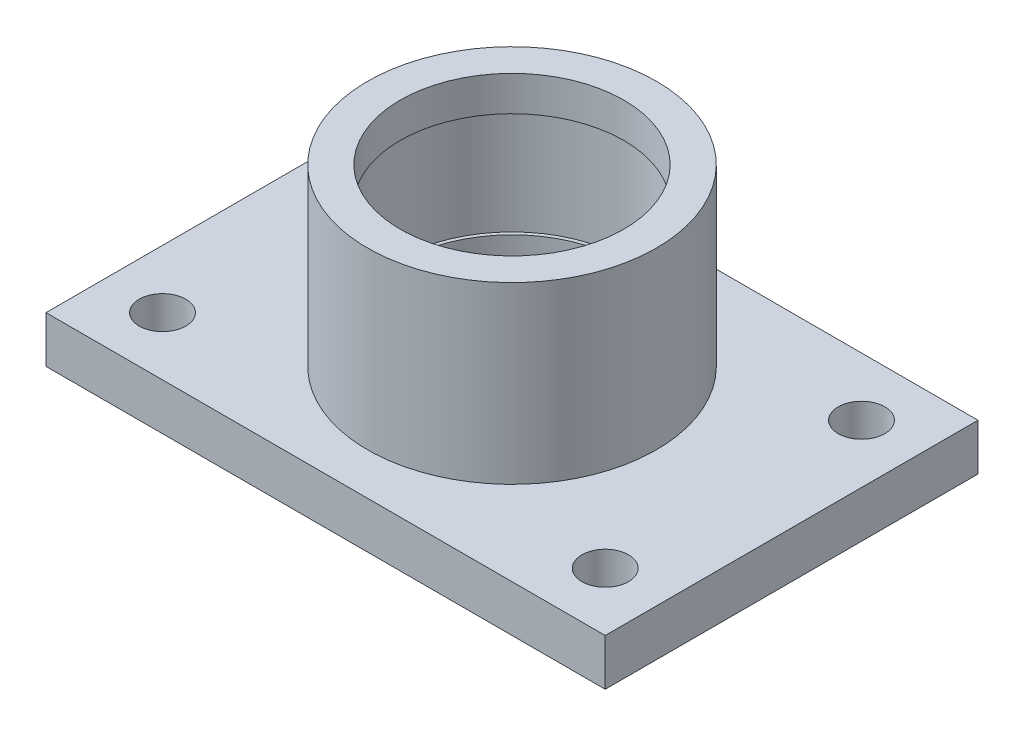
ISO-10303-21;
HEADER;
FILE_DESCRIPTION(('STEP AP214'),'2;1');
FILE_NAME('part.step','',(''),(''),'','','');
FILE_SCHEMA(('AUTOMOTIVE_DESIGN { 1 0 10303 214 1 1 1 1 }'));
ENDSEC;
DATA;
#1=APPLICATION_CONTEXT('core data for automotive mechanical design processes');
#2=APPLICATION_PROTOCOL_DEFINITION('international standard','automotive_design',2000,#1);
#3=PRODUCT_CONTEXT('',#1,'mechanical');
#4=PRODUCT('Part','Part','',(#3));
#5=PRODUCT_RELATED_PRODUCT_CATEGORY('part','',(#4));
#6=PRODUCT_DEFINITION_FORMATION('','',#4);
#7=PRODUCT_DEFINITION_CONTEXT('part definition',#1,'design');
#8=PRODUCT_DEFINITION('design','',#6,#7);
#9=PRODUCT_DEFINITION_SHAPE('','',#8);
#10=(LENGTH_UNIT() NAMED_UNIT(*) SI_UNIT(.MILLI.,.METRE.));
#11=(NAMED_UNIT(*) PLANE_ANGLE_UNIT() SI_UNIT($,.RADIAN.));
#12=(NAMED_UNIT(*) SI_UNIT($,.STERADIAN.) SOLID_ANGLE_UNIT());
#13=UNCERTAINTY_MEASURE_WITH_UNIT(LENGTH_MEASURE(1.E-05),#10,'distance_accuracy_value','');
#14=(GEOMETRIC_REPRESENTATION_CONTEXT(3) GLOBAL_UNCERTAINTY_ASSIGNED_CONTEXT((#13)) GLOBAL_UNIT_ASSIGNED_CONTEXT((#10,
#11,#12)) REPRESENTATION_CONTEXT('',''));
#15=CARTESIAN_POINT('',(0.,0.,0.));
#16=DIRECTION('',(0.,0.,1.));
#17=DIRECTION('',(1.,0.,0.));
#18=AXIS2_PLACEMENT_3D('',#15,#16,#17);
#19=CARTESIAN_POINT('',(95.,20.,55.));
#20=DIRECTION('',(0.,-1.,0.));
#21=DIRECTION('',(0.,0.,-1.));
#22=AXIS2_PLACEMENT_3D('',#19,#20,#21);
#23=CYLINDRICAL_SURFACE('',#22,9.99999999999999);
#24=CARTESIAN_POINT('',(95.,20.,55.));
#25=DIRECTION('',(0.,-1.,0.));
#26=DIRECTION('',(0.,0.,-1.));
#27=AXIS2_PLACEMENT_3D('',#24,#25,#26);
#28=CIRCLE('',#27,9.99999999999999);
#29=CARTESIAN_POINT('',(95.,20.,45.));
#30=VERTEX_POINT('',#29);
#31=EDGE_CURVE('E187',#30,#30,#28,.T.);
#32=ORIENTED_EDGE('',*,*,#31,.F.);
#33=EDGE_LOOP('',(#32));
#34=FACE_BOUND('',#33,.T.);
#35=CARTESIAN_POINT('',(95.,3.,55.));
#36=DIRECTION('',(0.,-1.,0.));
#37=DIRECTION('',(0.,0.,-1.));
#38=AXIS2_PLACEMENT_3D('',#35,#36,#37);
#39=CIRCLE('',#38,9.99999999999999);
#40=CARTESIAN_POINT('',(95.,3.,45.));
#41=VERTEX_POINT('',#40);
#42=EDGE_CURVE('E178',#41,#41,#39,.F.);
#43=ORIENTED_EDGE('',*,*,#42,.F.);
#44=EDGE_LOOP('',(#43));
#45=FACE_BOUND('',#44,.T.);
#46=ADVANCED_FACE('F39',(#34,#45),#23,.F.);
#47=CARTESIAN_POINT('',(-95.,20.,54.9999999999987));
#48=DIRECTION('',(0.,-1.,0.));
#49=DIRECTION('',(0.,0.,-1.));
#50=AXIS2_PLACEMENT_3D('',#47,#48,#49);
#51=CYLINDRICAL_SURFACE('',#50,9.99999999999999);
#52=CARTESIAN_POINT('',(-95.,20.,54.9999999999987));
#53=DIRECTION('',(0.,-1.,0.));
#54=DIRECTION('',(0.,0.,-1.));
#55=AXIS2_PLACEMENT_3D('',#52,#53,#54);
#56=CIRCLE('',#55,9.99999999999999);
#57=CARTESIAN_POINT('',(-95.,20.,44.9999999999987));
#58=VERTEX_POINT('',#57);
#59=EDGE_CURVE('E183',#58,#58,#56,.T.);
#60=ORIENTED_EDGE('',*,*,#59,.F.);
#61=EDGE_LOOP('',(#60));
#62=FACE_BOUND('',#61,.T.);
#63=CARTESIAN_POINT('',(-95.,3.,54.9999999999987));
#64=DIRECTION('',(0.,-1.,0.));
#65=DIRECTION('',(0.,0.,-1.));
#66=AXIS2_PLACEMENT_3D('',#63,#64,#65);
#67=CIRCLE('',#66,9.99999999999999);
#68=CARTESIAN_POINT('',(-95.,3.,44.9999999999987));
#69=VERTEX_POINT('',#68);
#70=EDGE_CURVE('E174',#69,#69,#67,.F.);
#71=ORIENTED_EDGE('',*,*,#70,.F.);
#72=EDGE_LOOP('',(#71));
#73=FACE_BOUND('',#72,.T.);
#74=ADVANCED_FACE('F286',(#62,#73),#51,.F.);
#75=CARTESIAN_POINT('',(-94.9999999999988,20.,-55.0000000000013));
#76=DIRECTION('',(0.,-1.,0.));
#77=DIRECTION('',(0.,0.,-1.));
#78=AXIS2_PLACEMENT_3D('',#75,#76,#77);
#79=CYLINDRICAL_SURFACE('',#78,9.99999999999999);
#80=CARTESIAN_POINT('',(-94.9999999999988,20.,-55.0000000000013));
#81=DIRECTION('',(0.,-1.,0.));
#82=DIRECTION('',(0.,0.,-1.));
#83=AXIS2_PLACEMENT_3D('',#80,#81,#82);
#84=CIRCLE('',#83,9.99999999999999);
#85=CARTESIAN_POINT('',(-94.9999999999988,20.,-65.0000000000013));
#86=VERTEX_POINT('',#85);
#87=EDGE_CURVE('E188',#86,#86,#84,.T.);
#88=ORIENTED_EDGE('',*,*,#87,.F.);
#89=EDGE_LOOP('',(#88));
#90=FACE_BOUND('',#89,.T.);
#91=CARTESIAN_POINT('',(-94.9999999999988,3.,-55.0000000000013));
#92=DIRECTION('',(0.,-1.,0.));
#93=DIRECTION('',(0.,0.,-1.));
#94=AXIS2_PLACEMENT_3D('',#91,#92,#93);
#95=CIRCLE('',#94,9.99999999999999);
#96=CARTESIAN_POINT('',(-94.9999999999988,3.,-65.0000000000013));
#97=VERTEX_POINT('',#96);
#98=EDGE_CURVE('E170',#97,#97,#95,.F.);
#99=ORIENTED_EDGE('',*,*,#98,.F.);
#100=EDGE_LOOP('',(#99));
#101=FACE_BOUND('',#100,.T.);
#102=ADVANCED_FACE('F292',(#90,#101),#79,.F.);
#103=CARTESIAN_POINT('',(95.0000000000012,20.,-55.));
#104=DIRECTION('',(0.,-1.,0.));
#105=DIRECTION('',(0.,0.,-1.));
#106=AXIS2_PLACEMENT_3D('',#103,#104,#105);
#107=CYLINDRICAL_SURFACE('',#106,9.99999999999999);
#108=CARTESIAN_POINT('',(95.0000000000012,20.,-55.));
#109=DIRECTION('',(0.,-1.,0.));
#110=DIRECTION('',(0.,0.,-1.));
#111=AXIS2_PLACEMENT_3D('',#108,#109,#110);
#112=CIRCLE('',#111,9.99999999999999);
#113=CARTESIAN_POINT('',(95.0000000000012,20.,-65.));
#114=VERTEX_POINT('',#113);
#115=EDGE_CURVE('E182',#114,#114,#112,.T.);
#116=ORIENTED_EDGE('',*,*,#115,.F.);
#117=EDGE_LOOP('',(#116));
#118=FACE_BOUND('',#117,.T.);
#119=CARTESIAN_POINT('',(95.0000000000012,3.,-55.));
#120=DIRECTION('',(0.,-1.,0.));
#121=DIRECTION('',(0.,0.,-1.));
#122=AXIS2_PLACEMENT_3D('',#119,#120,#121);
#123=CIRCLE('',#122,9.99999999999999);
#124=CARTESIAN_POINT('',(95.0000000000012,3.,-65.));
#125=VERTEX_POINT('',#124);
#126=EDGE_CURVE('E43',#125,#125,#123,.F.);
#127=ORIENTED_EDGE('',*,*,#126,.F.);
#128=EDGE_LOOP('',(#127));
#129=FACE_BOUND('',#128,.T.);
#130=ADVANCED_FACE('F299',(#118,#129),#107,.F.);
#131=CARTESIAN_POINT('',(-120.,20.,80.));
#132=DIRECTION('',(1.,0.,0.));
#133=DIRECTION('',(0.,0.,-1.));
#134=AXIS2_PLACEMENT_3D('',#131,#132,#133);
#135=PLANE('',#134);
#136=DIRECTION('',(0.,0.,1.));
#137=VECTOR('',#136,1.);
#138=CARTESIAN_POINT('',(-120.,0.,80.));
#139=LINE('',#138,#137);
#140=CARTESIAN_POINT('',(-120.,0.,-80.));
#141=VERTEX_POINT('',#140);
#142=CARTESIAN_POINT('',(-120.,0.,80.));
#143=VERTEX_POINT('',#142);
#144=EDGE_CURVE('E230',#141,#143,#139,.T.);
#145=ORIENTED_EDGE('',*,*,#144,.T.);
#146=DIRECTION('',(0.,-1.,0.));
#147=VECTOR('',#146,1.);
#148=CARTESIAN_POINT('',(-120.,20.,80.));
#149=LINE('',#148,#147);
#150=CARTESIAN_POINT('',(-120.,20.,80.));
#151=VERTEX_POINT('',#150);
#152=EDGE_CURVE('E11',#151,#143,#149,.T.);
#153=ORIENTED_EDGE('',*,*,#152,.F.);
#154=DIRECTION('',(0.,0.,1.));
#155=VECTOR('',#154,1.);
#156=CARTESIAN_POINT('',(-120.,20.,80.));
#157=LINE('',#156,#155);
#158=CARTESIAN_POINT('',(-120.,20.,-80.));
#159=VERTEX_POINT('',#158);
#160=EDGE_CURVE('E231',#159,#151,#157,.T.);
#161=ORIENTED_EDGE('',*,*,#160,.F.);
#162=DIRECTION('',(0.,-1.,0.));
#163=VECTOR('',#162,1.);
#164=CARTESIAN_POINT('',(-120.,20.,-80.));
#165=LINE('',#164,#163);
#166=EDGE_CURVE('E241',#159,#141,#165,.T.);
#167=ORIENTED_EDGE('',*,*,#166,.T.);
#168=EDGE_LOOP('',(#145,#153,#161,#167));
#169=FACE_BOUND('',#168,.T.);
#170=ADVANCED_FACE('F41',(#169),#135,.F.);
#171=CARTESIAN_POINT('',(-120.,20.,80.));
#172=DIRECTION('',(0.,0.,-1.));
#173=DIRECTION('',(-1.,0.,0.));
#174=AXIS2_PLACEMENT_3D('',#171,#172,#173);
#175=PLANE('',#174);
#176=DIRECTION('',(1.,0.,0.));
#177=VECTOR('',#176,1.);
#178=CARTESIAN_POINT('',(-120.,0.,80.));
#179=LINE('',#178,#177);
#180=CARTESIAN_POINT('',(120.,0.,80.));
#181=VERTEX_POINT('',#180);
#182=EDGE_CURVE('E245',#143,#181,#179,.T.);
#183=ORIENTED_EDGE('',*,*,#182,.T.);
#184=DIRECTION('',(0.,-1.,0.));
#185=VECTOR('',#184,1.);
#186=CARTESIAN_POINT('',(120.,20.,80.));
#187=LINE('',#186,#185);
#188=CARTESIAN_POINT('',(120.,20.,80.));
#189=VERTEX_POINT('',#188);
#190=EDGE_CURVE('E49',#189,#181,#187,.T.);
#191=ORIENTED_EDGE('',*,*,#190,.F.);
#192=DIRECTION('',(1.,0.,0.));
#193=VECTOR('',#192,1.);
#194=CARTESIAN_POINT('',(-120.,20.,80.));
#195=LINE('',#194,#193);
#196=EDGE_CURVE('E93',#151,#189,#195,.T.);
#197=ORIENTED_EDGE('',*,*,#196,.F.);
#198=ORIENTED_EDGE('',*,*,#152,.T.);
#199=EDGE_LOOP('',(#183,#191,#197,#198));
#200=FACE_BOUND('',#199,.T.);
#201=ADVANCED_FACE('F282',(#200),#175,.F.);
#202=CARTESIAN_POINT('',(120.,20.,80.));
#203=DIRECTION('',(-1.,0.,0.));
#204=DIRECTION('',(0.,0.,1.));
#205=AXIS2_PLACEMENT_3D('',#202,#203,#204);
#206=PLANE('',#205);
#207=DIRECTION('',(0.,0.,-1.));
#208=VECTOR('',#207,1.);
#209=CARTESIAN_POINT('',(120.,0.,80.));
#210=LINE('',#209,#208);
#211=CARTESIAN_POINT('',(120.,0.,-80.));
#212=VERTEX_POINT('',#211);
#213=EDGE_CURVE('E248',#181,#212,#210,.T.);
#214=ORIENTED_EDGE('',*,*,#213,.T.);
#215=DIRECTION('',(0.,-1.,0.));
#216=VECTOR('',#215,1.);
#217=CARTESIAN_POINT('',(120.,20.,-80.));
#218=LINE('',#217,#216);
#219=CARTESIAN_POINT('',(120.,20.,-80.));
#220=VERTEX_POINT('',#219);
#221=EDGE_CURVE('E255',#220,#212,#218,.T.);
#222=ORIENTED_EDGE('',*,*,#221,.F.);
#223=DIRECTION('',(0.,0.,-1.));
#224=VECTOR('',#223,1.);
#225=CARTESIAN_POINT('',(120.,20.,80.));
#226=LINE('',#225,#224);
#227=EDGE_CURVE('E236',#189,#220,#226,.T.);
#228=ORIENTED_EDGE('',*,*,#227,.F.);
#229=ORIENTED_EDGE('',*,*,#190,.T.);
#230=EDGE_LOOP('',(#214,#222,#228,#229));
#231=FACE_BOUND('',#230,.T.);
#232=ADVANCED_FACE('F263',(#231),#206,.F.);
#233=CARTESIAN_POINT('',(-120.,20.,-80.));
#234=DIRECTION('',(0.,0.,1.));
#235=DIRECTION('',(1.,0.,0.));
#236=AXIS2_PLACEMENT_3D('',#233,#234,#235);
#237=PLANE('',#236);
#238=DIRECTION('',(-1.,0.,0.));
#239=VECTOR('',#238,1.);
#240=CARTESIAN_POINT('',(-120.,0.,-80.));
#241=LINE('',#240,#239);
#242=EDGE_CURVE('E86',#212,#141,#241,.T.);
#243=ORIENTED_EDGE('',*,*,#242,.T.);
#244=ORIENTED_EDGE('',*,*,#166,.F.);
#245=DIRECTION('',(-1.,0.,0.));
#246=VECTOR('',#245,1.);
#247=CARTESIAN_POINT('',(-120.,20.,-80.));
#248=LINE('',#247,#246);
#249=EDGE_CURVE('E65',#220,#159,#248,.T.);
#250=ORIENTED_EDGE('',*,*,#249,.F.);
#251=ORIENTED_EDGE('',*,*,#221,.T.);
#252=EDGE_LOOP('',(#243,#244,#250,#251));
#253=FACE_BOUND('',#252,.T.);
#254=ADVANCED_FACE('F271',(#253),#237,.F.);
#255=CARTESIAN_POINT('',(0.,20.,0.));
#256=DIRECTION('',(0.,-1.,0.));
#257=DIRECTION('',(0.,0.,-1.));
#258=AXIS2_PLACEMENT_3D('',#255,#256,#257);
#259=PLANE('',#258);
#260=ORIENTED_EDGE('',*,*,#115,.T.);
#261=EDGE_LOOP('',(#260));
#262=FACE_BOUND('',#261,.T.);
#263=ORIENTED_EDGE('',*,*,#87,.T.);
#264=EDGE_LOOP('',(#263));
#265=FACE_BOUND('',#264,.T.);
#266=ORIENTED_EDGE('',*,*,#59,.T.);
#267=EDGE_LOOP('',(#266));
#268=FACE_BOUND('',#267,.T.);
#269=ORIENTED_EDGE('',*,*,#31,.T.);
#270=EDGE_LOOP('',(#269));
#271=FACE_BOUND('',#270,.T.);
#272=CARTESIAN_POINT('',(0.,20.,0.));
#273=DIRECTION('',(0.,-1.,0.));
#274=DIRECTION('',(0.,0.,-1.));
#275=AXIS2_PLACEMENT_3D('',#272,#273,#274);
#276=CIRCLE('',#275,62.);
#277=CARTESIAN_POINT('',(0.,20.,-62.));
#278=VERTEX_POINT('',#277);
#279=EDGE_CURVE('E198',#278,#278,#276,.T.);
#280=ORIENTED_EDGE('',*,*,#279,.T.);
#281=EDGE_LOOP('',(#280));
#282=FACE_BOUND('',#281,.T.);
#283=ORIENTED_EDGE('',*,*,#160,.T.);
#284=ORIENTED_EDGE('',*,*,#196,.T.);
#285=ORIENTED_EDGE('',*,*,#227,.T.);
#286=ORIENTED_EDGE('',*,*,#249,.T.);
#287=EDGE_LOOP('',(#283,#284,#285,#286));
#288=FACE_BOUND('',#287,.T.);
#289=ADVANCED_FACE('F273',(#262,#265,#268,#271,#282,#288),#259,.F.);
#290=CARTESIAN_POINT('',(0.,0.,0.));
#291=DIRECTION('',(0.,-1.,0.));
#292=DIRECTION('',(0.,0.,-1.));
#293=AXIS2_PLACEMENT_3D('',#290,#291,#292);
#294=PLANE('',#293);
#295=DIRECTION('',(0.,0.,-1.));
#296=VECTOR('',#295,1.);
#297=CARTESIAN_POINT('',(-110.,0.,70.));
#298=LINE('',#297,#296);
#299=CARTESIAN_POINT('',(-110.,0.,70.));
#300=VERTEX_POINT('',#299);
#301=CARTESIAN_POINT('',(-110.,0.,-70.));
#302=VERTEX_POINT('',#301);
#303=EDGE_CURVE('E56',#300,#302,#298,.T.);
#304=ORIENTED_EDGE('',*,*,#303,.F.);
#305=DIRECTION('',(-1.,0.,0.));
#306=VECTOR('',#305,1.);
#307=CARTESIAN_POINT('',(-110.,0.,70.));
#308=LINE('',#307,#306);
#309=CARTESIAN_POINT('',(110.,0.,70.));
#310=VERTEX_POINT('',#309);
#311=EDGE_CURVE('E139',#310,#300,#308,.T.);
#312=ORIENTED_EDGE('',*,*,#311,.F.);
#313=DIRECTION('',(0.,0.,1.));
#314=VECTOR('',#313,1.);
#315=CARTESIAN_POINT('',(110.,0.,70.));
#316=LINE('',#315,#314);
#317=CARTESIAN_POINT('',(110.,0.,-70.));
#318=VERTEX_POINT('',#317);
#319=EDGE_CURVE('E143',#318,#310,#316,.T.);
#320=ORIENTED_EDGE('',*,*,#319,.F.);
#321=DIRECTION('',(1.,0.,0.));
#322=VECTOR('',#321,1.);
#323=CARTESIAN_POINT('',(-110.,0.,-70.));
#324=LINE('',#323,#322);
#325=EDGE_CURVE('E155',#302,#318,#324,.T.);
#326=ORIENTED_EDGE('',*,*,#325,.F.);
#327=EDGE_LOOP('',(#304,#312,#320,#326));
#328=FACE_BOUND('',#327,.T.);
#329=ORIENTED_EDGE('',*,*,#144,.F.);
#330=ORIENTED_EDGE('',*,*,#242,.F.);
#331=ORIENTED_EDGE('',*,*,#213,.F.);
#332=ORIENTED_EDGE('',*,*,#182,.F.);
#333=EDGE_LOOP('',(#329,#330,#331,#332));
#334=FACE_BOUND('',#333,.T.);
#335=ADVANCED_FACE('F267',(#328,#334),#294,.T.);
#336=CARTESIAN_POINT('',(0.,-30.4275679527639,0.));
#337=DIRECTION('',(0.,-1.,0.));
#338=DIRECTION('',(0.,0.,-1.));
#339=AXIS2_PLACEMENT_3D('',#336,#337,#338);
#340=CYLINDRICAL_SURFACE('',#339,48.);
#341=CARTESIAN_POINT('',(0.,20.,0.));
#342=DIRECTION('',(0.,-1.,0.));
#343=DIRECTION('',(0.,0.,-1.));
#344=AXIS2_PLACEMENT_3D('',#341,#342,#343);
#345=CIRCLE('',#344,48.);
#346=CARTESIAN_POINT('',(0.,20.,-48.));
#347=VERTEX_POINT('',#346);
#348=EDGE_CURVE('E226',#347,#347,#345,.T.);
#349=ORIENTED_EDGE('',*,*,#348,.T.);
#350=EDGE_LOOP('',(#349));
#351=FACE_BOUND('',#350,.T.);
#352=CARTESIAN_POINT('',(0.,35.,0.));
#353=DIRECTION('',(0.,-1.,0.));
#354=DIRECTION('',(0.,0.,-1.));
#355=AXIS2_PLACEMENT_3D('',#352,#353,#354);
#356=CIRCLE('',#355,48.);
#357=CARTESIAN_POINT('',(0.,35.,-48.));
#358=VERTEX_POINT('',#357);
#359=EDGE_CURVE('E222',#358,#358,#356,.T.);
#360=ORIENTED_EDGE('',*,*,#359,.F.);
#361=EDGE_LOOP('',(#360));
#362=FACE_BOUND('',#361,.T.);
#363=ADVANCED_FACE('F324',(#351,#362),#340,.F.);
#364=CARTESIAN_POINT('',(48.,35.,0.));
#365=DIRECTION('',(0.,1.,0.));
#366=DIRECTION('',(0.,0.,1.));
#367=AXIS2_PLACEMENT_3D('',#364,#365,#366);
#368=PLANE('',#367);
#369=ORIENTED_EDGE('',*,*,#359,.T.);
#370=EDGE_LOOP('',(#369));
#371=FACE_BOUND('',#370,.T.);
#372=CARTESIAN_POINT('',(0.,35.,0.));
#373=DIRECTION('',(0.,-1.,0.));
#374=DIRECTION('',(0.,0.,-1.));
#375=AXIS2_PLACEMENT_3D('',#372,#373,#374);
#376=CIRCLE('',#375,49.5);
#377=CARTESIAN_POINT('',(0.,35.,-49.5));
#378=VERTEX_POINT('',#377);
#379=EDGE_CURVE('E218',#378,#378,#376,.T.);
#380=ORIENTED_EDGE('',*,*,#379,.F.);
#381=EDGE_LOOP('',(#380));
#382=FACE_BOUND('',#381,.T.);
#383=ADVANCED_FACE('F320',(#371,#382),#368,.T.);
#384=CARTESIAN_POINT('',(0.,-30.4275679527639,0.));
#385=DIRECTION('',(0.,-1.,0.));
#386=DIRECTION('',(0.,0.,-1.));
#387=AXIS2_PLACEMENT_3D('',#384,#385,#386);
#388=CYLINDRICAL_SURFACE('',#387,49.5);
#389=ORIENTED_EDGE('',*,*,#379,.T.);
#390=EDGE_LOOP('',(#389));
#391=FACE_BOUND('',#390,.T.);
#392=CARTESIAN_POINT('',(0.,80.,0.));
#393=DIRECTION('',(0.,-1.,0.));
#394=DIRECTION('',(0.,0.,-1.));
#395=AXIS2_PLACEMENT_3D('',#392,#393,#394);
#396=CIRCLE('',#395,49.5);
#397=CARTESIAN_POINT('',(0.,80.,-49.5));
#398=VERTEX_POINT('',#397);
#399=EDGE_CURVE('E214',#398,#398,#396,.T.);
#400=ORIENTED_EDGE('',*,*,#399,.F.);
#401=EDGE_LOOP('',(#400));
#402=FACE_BOUND('',#401,.T.);
#403=ADVANCED_FACE('F316',(#391,#402),#388,.F.);
#404=CARTESIAN_POINT('',(49.5,80.,0.));
#405=DIRECTION('',(0.,-1.,0.));
#406=DIRECTION('',(0.,0.,-1.));
#407=AXIS2_PLACEMENT_3D('',#404,#405,#406);
#408=PLANE('',#407);
#409=ORIENTED_EDGE('',*,*,#399,.T.);
#410=EDGE_LOOP('',(#409));
#411=FACE_BOUND('',#410,.T.);
#412=CARTESIAN_POINT('',(0.,80.,0.));
#413=DIRECTION('',(0.,-1.,0.));
#414=DIRECTION('',(0.,0.,-1.));
#415=AXIS2_PLACEMENT_3D('',#412,#413,#414);
#416=CIRCLE('',#415,48.);
#417=CARTESIAN_POINT('',(0.,80.,-48.));
#418=VERTEX_POINT('',#417);
#419=EDGE_CURVE('E210',#418,#418,#416,.T.);
#420=ORIENTED_EDGE('',*,*,#419,.F.);
#421=EDGE_LOOP('',(#420));
#422=FACE_BOUND('',#421,.T.);
#423=ADVANCED_FACE('F312',(#411,#422),#408,.T.);
#424=CARTESIAN_POINT('',(0.,-30.4275679527639,0.));
#425=DIRECTION('',(0.,-1.,0.));
#426=DIRECTION('',(0.,0.,-1.));
#427=AXIS2_PLACEMENT_3D('',#424,#425,#426);
#428=CYLINDRICAL_SURFACE('',#427,48.);
#429=ORIENTED_EDGE('',*,*,#419,.T.);
#430=EDGE_LOOP('',(#429));
#431=FACE_BOUND('',#430,.T.);
#432=CARTESIAN_POINT('',(0.,95.,0.));
#433=DIRECTION('',(0.,-1.,0.));
#434=DIRECTION('',(0.,0.,-1.));
#435=AXIS2_PLACEMENT_3D('',#432,#433,#434);
#436=CIRCLE('',#435,48.);
#437=CARTESIAN_POINT('',(0.,95.,-48.));
#438=VERTEX_POINT('',#437);
#439=EDGE_CURVE('E206',#438,#438,#436,.T.);
#440=ORIENTED_EDGE('',*,*,#439,.F.);
#441=EDGE_LOOP('',(#440));
#442=FACE_BOUND('',#441,.T.);
#443=ADVANCED_FACE('F308',(#431,#442),#428,.F.);
#444=CARTESIAN_POINT('',(48.,95.,0.));
#445=DIRECTION('',(0.,1.,0.));
#446=DIRECTION('',(0.,0.,1.));
#447=AXIS2_PLACEMENT_3D('',#444,#445,#446);
#448=PLANE('',#447);
#449=ORIENTED_EDGE('',*,*,#439,.T.);
#450=EDGE_LOOP('',(#449));
#451=FACE_BOUND('',#450,.T.);
#452=CARTESIAN_POINT('',(0.,95.,0.));
#453=DIRECTION('',(0.,-1.,0.));
#454=DIRECTION('',(0.,0.,-1.));
#455=AXIS2_PLACEMENT_3D('',#452,#453,#454);
#456=CIRCLE('',#455,62.);
#457=CARTESIAN_POINT('',(0.,95.,-62.));
#458=VERTEX_POINT('',#457);
#459=EDGE_CURVE('E202',#458,#458,#456,.T.);
#460=ORIENTED_EDGE('',*,*,#459,.F.);
#461=EDGE_LOOP('',(#460));
#462=FACE_BOUND('',#461,.T.);
#463=ADVANCED_FACE('F304',(#451,#462),#448,.T.);
#464=CARTESIAN_POINT('',(0.,-30.4275679527639,0.));
#465=DIRECTION('',(0.,-1.,0.));
#466=DIRECTION('',(0.,0.,-1.));
#467=AXIS2_PLACEMENT_3D('',#464,#465,#466);
#468=CYLINDRICAL_SURFACE('',#467,62.);
#469=ORIENTED_EDGE('',*,*,#459,.T.);
#470=EDGE_LOOP('',(#469));
#471=FACE_BOUND('',#470,.T.);
#472=ORIENTED_EDGE('',*,*,#279,.F.);
#473=EDGE_LOOP('',(#472));
#474=FACE_BOUND('',#473,.T.);
#475=ADVANCED_FACE('F301',(#471,#474),#468,.T.);
#476=CARTESIAN_POINT('',(12.,20.,0.));
#477=DIRECTION('',(0.,1.,0.));
#478=DIRECTION('',(0.,0.,1.));
#479=AXIS2_PLACEMENT_3D('',#476,#477,#478);
#480=CIRCLE('',#479,3.);
#481=CARTESIAN_POINT('',(12.,20.,3.));
#482=VERTEX_POINT('',#481);
#483=EDGE_CURVE('E146',#482,#482,#480,.T.);
#484=ORIENTED_EDGE('',*,*,#483,.F.);
#485=EDGE_LOOP('',(#484));
#486=FACE_BOUND('',#485,.T.);
#487=ORIENTED_EDGE('',*,*,#348,.F.);
#488=EDGE_LOOP('',(#487));
#489=FACE_BOUND('',#488,.T.);
#490=ADVANCED_FACE('F281',(#486,#489),#259,.F.);
#491=CARTESIAN_POINT('',(0.,3.,0.));
#492=DIRECTION('',(0.,-1.,0.));
#493=DIRECTION('',(0.,0.,-1.));
#494=AXIS2_PLACEMENT_3D('',#491,#492,#493);
#495=PLANE('',#494);
#496=DIRECTION('',(0.,0.,-1.));
#497=VECTOR('',#496,1.);
#498=CARTESIAN_POINT('',(-110.,3.,70.));
#499=LINE('',#498,#497);
#500=CARTESIAN_POINT('',(-110.,3.,70.));
#501=VERTEX_POINT('',#500);
#502=CARTESIAN_POINT('',(-110.,3.,-70.));
#503=VERTEX_POINT('',#502);
#504=EDGE_CURVE('E117',#501,#503,#499,.T.);
#505=ORIENTED_EDGE('',*,*,#504,.T.);
#506=DIRECTION('',(1.,0.,0.));
#507=VECTOR('',#506,1.);
#508=CARTESIAN_POINT('',(-110.,3.,-70.));
#509=LINE('',#508,#507);
#510=CARTESIAN_POINT('',(110.,3.,-70.));
#511=VERTEX_POINT('',#510);
#512=EDGE_CURVE('E127',#503,#511,#509,.T.);
#513=ORIENTED_EDGE('',*,*,#512,.T.);
#514=DIRECTION('',(0.,0.,1.));
#515=VECTOR('',#514,1.);
#516=CARTESIAN_POINT('',(110.,3.,70.));
#517=LINE('',#516,#515);
#518=CARTESIAN_POINT('',(110.,3.,70.));
#519=VERTEX_POINT('',#518);
#520=EDGE_CURVE('E133',#511,#519,#517,.T.);
#521=ORIENTED_EDGE('',*,*,#520,.T.);
#522=DIRECTION('',(-1.,0.,0.));
#523=VECTOR('',#522,1.);
#524=CARTESIAN_POINT('',(-110.,3.,70.));
#525=LINE('',#524,#523);
#526=EDGE_CURVE('E124',#519,#501,#525,.T.);
#527=ORIENTED_EDGE('',*,*,#526,.T.);
#528=EDGE_LOOP('',(#505,#513,#521,#527));
#529=FACE_BOUND('',#528,.T.);
#530=ORIENTED_EDGE('',*,*,#126,.T.);
#531=EDGE_LOOP('',(#530));
#532=FACE_BOUND('',#531,.T.);
#533=ORIENTED_EDGE('',*,*,#98,.T.);
#534=EDGE_LOOP('',(#533));
#535=FACE_BOUND('',#534,.T.);
#536=ORIENTED_EDGE('',*,*,#70,.T.);
#537=EDGE_LOOP('',(#536));
#538=FACE_BOUND('',#537,.T.);
#539=ORIENTED_EDGE('',*,*,#42,.T.);
#540=EDGE_LOOP('',(#539));
#541=FACE_BOUND('',#540,.T.);
#542=ADVANCED_FACE('F135',(#529,#532,#535,#538,#541),#495,.T.);
#543=CARTESIAN_POINT('',(-110.,3.,70.));
#544=DIRECTION('',(-1.,0.,0.));
#545=DIRECTION('',(0.,0.,1.));
#546=AXIS2_PLACEMENT_3D('',#543,#544,#545);
#547=PLANE('',#546);
#548=ORIENTED_EDGE('',*,*,#303,.T.);
#549=DIRECTION('',(0.,-1.,0.));
#550=VECTOR('',#549,1.);
#551=CARTESIAN_POINT('',(-110.,3.,-70.));
#552=LINE('',#551,#550);
#553=EDGE_CURVE('E113',#503,#302,#552,.T.);
#554=ORIENTED_EDGE('',*,*,#553,.F.);
#555=ORIENTED_EDGE('',*,*,#504,.F.);
#556=DIRECTION('',(0.,-1.,0.));
#557=VECTOR('',#556,1.);
#558=CARTESIAN_POINT('',(-110.,3.,70.));
#559=LINE('',#558,#557);
#560=EDGE_CURVE('E162',#501,#300,#559,.T.);
#561=ORIENTED_EDGE('',*,*,#560,.T.);
#562=EDGE_LOOP('',(#548,#554,#555,#561));
#563=FACE_BOUND('',#562,.T.);
#564=ADVANCED_FACE('F115',(#563),#547,.F.);
#565=CARTESIAN_POINT('',(-110.,3.,70.));
#566=DIRECTION('',(0.,0.,1.));
#567=DIRECTION('',(1.,0.,0.));
#568=AXIS2_PLACEMENT_3D('',#565,#566,#567);
#569=PLANE('',#568);
#570=ORIENTED_EDGE('',*,*,#311,.T.);
#571=ORIENTED_EDGE('',*,*,#560,.F.);
#572=ORIENTED_EDGE('',*,*,#526,.F.);
#573=DIRECTION('',(0.,-1.,0.));
#574=VECTOR('',#573,1.);
#575=CARTESIAN_POINT('',(110.,3.,70.));
#576=LINE('',#575,#574);
#577=EDGE_CURVE('E165',#519,#310,#576,.T.);
#578=ORIENTED_EDGE('',*,*,#577,.T.);
#579=EDGE_LOOP('',(#570,#571,#572,#578));
#580=FACE_BOUND('',#579,.T.);
#581=ADVANCED_FACE('F337',(#580),#569,.F.);
#582=CARTESIAN_POINT('',(110.,3.,70.));
#583=DIRECTION('',(1.,0.,0.));
#584=DIRECTION('',(0.,0.,-1.));
#585=AXIS2_PLACEMENT_3D('',#582,#583,#584);
#586=PLANE('',#585);
#587=ORIENTED_EDGE('',*,*,#319,.T.);
#588=ORIENTED_EDGE('',*,*,#577,.F.);
#589=ORIENTED_EDGE('',*,*,#520,.F.);
#590=DIRECTION('',(0.,-1.,0.));
#591=VECTOR('',#590,1.);
#592=CARTESIAN_POINT('',(110.,3.,-70.));
#593=LINE('',#592,#591);
#594=EDGE_CURVE('E123',#511,#318,#593,.T.);
#595=ORIENTED_EDGE('',*,*,#594,.T.);
#596=EDGE_LOOP('',(#587,#588,#589,#595));
#597=FACE_BOUND('',#596,.T.);
#598=ADVANCED_FACE('F335',(#597),#586,.F.);
#599=CARTESIAN_POINT('',(-110.,3.,-70.));
#600=DIRECTION('',(0.,0.,-1.));
#601=DIRECTION('',(-1.,0.,0.));
#602=AXIS2_PLACEMENT_3D('',#599,#600,#601);
#603=PLANE('',#602);
#604=ORIENTED_EDGE('',*,*,#325,.T.);
#605=ORIENTED_EDGE('',*,*,#594,.F.);
#606=ORIENTED_EDGE('',*,*,#512,.F.);
#607=ORIENTED_EDGE('',*,*,#553,.T.);
#608=EDGE_LOOP('',(#604,#605,#606,#607));
#609=FACE_BOUND('',#608,.T.);
#610=ADVANCED_FACE('F128',(#609),#603,.F.);
#611=CARTESIAN_POINT('',(12.,10.,0.));
#612=DIRECTION('',(0.,1.,0.));
#613=DIRECTION('',(0.,0.,1.));
#614=AXIS2_PLACEMENT_3D('',#611,#612,#613);
#615=CYLINDRICAL_SURFACE('',#614,3.);
#616=CARTESIAN_POINT('',(12.,10.,0.));
#617=DIRECTION('',(0.,1.,0.));
#618=DIRECTION('',(0.,0.,1.));
#619=AXIS2_PLACEMENT_3D('',#616,#617,#618);
#620=CIRCLE('',#619,3.);
#621=CARTESIAN_POINT('',(12.,10.,3.));
#622=VERTEX_POINT('',#621);
#623=EDGE_CURVE('E156',#622,#622,#620,.T.);
#624=ORIENTED_EDGE('',*,*,#623,.F.);
#625=EDGE_LOOP('',(#624));
#626=FACE_BOUND('',#625,.T.);
#627=ORIENTED_EDGE('',*,*,#483,.T.);
#628=EDGE_LOOP('',(#627));
#629=FACE_BOUND('',#628,.T.);
#630=ADVANCED_FACE('F350',(#626,#629),#615,.F.);
#631=CARTESIAN_POINT('',(12.,10.,0.));
#632=DIRECTION('',(0.,1.,0.));
#633=DIRECTION('',(0.,0.,1.));
#634=AXIS2_PLACEMENT_3D('',#631,#632,#633);
#635=PLANE('',#634);
#636=ORIENTED_EDGE('',*,*,#623,.T.);
#637=EDGE_LOOP('',(#636));
#638=FACE_BOUND('',#637,.T.);
#639=ADVANCED_FACE('F398',(#638),#635,.T.);
#640=CLOSED_SHELL('',(#46,#74,#102,#130,#170,#201,#232,#254,#289,#335,#363,#383,#403,#423,#443,
#463,#475,#490,#542,#564,#581,#598,#610,#630,#639));
#641=MANIFOLD_SOLID_BREP('B2',#640);
#642=ADVANCED_BREP_SHAPE_REPRESENTATION('',(#18,#641),#14);
#643=SHAPE_DEFINITION_REPRESENTATION(#9,#642);
ENDSEC;
END-ISO-10303-21;
